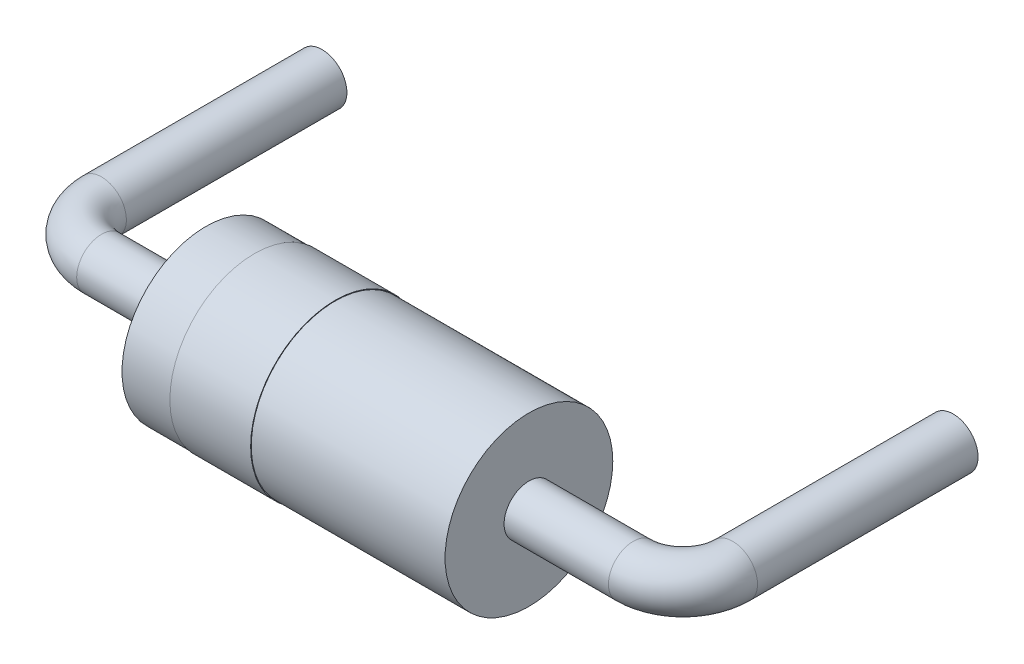
ISO-10303-21;
HEADER;
FILE_DESCRIPTION(('STEP AP214'),'2;1');
FILE_NAME('part.step','',(''),(''),'','','');
FILE_SCHEMA(('AUTOMOTIVE_DESIGN { 1 0 10303 214 1 1 1 1 }'));
ENDSEC;
DATA;
#1=APPLICATION_CONTEXT('core data for automotive mechanical design processes');
#2=APPLICATION_PROTOCOL_DEFINITION('international standard','automotive_design',2000,#1);
#3=PRODUCT_CONTEXT('',#1,'mechanical');
#4=PRODUCT('Part','Part','',(#3));
#5=PRODUCT_RELATED_PRODUCT_CATEGORY('part','',(#4));
#6=PRODUCT_DEFINITION_FORMATION('','',#4);
#7=PRODUCT_DEFINITION_CONTEXT('part definition',#1,'design');
#8=PRODUCT_DEFINITION('design','',#6,#7);
#9=PRODUCT_DEFINITION_SHAPE('','',#8);
#10=(LENGTH_UNIT() NAMED_UNIT(*) SI_UNIT(.MILLI.,.METRE.));
#11=(NAMED_UNIT(*) PLANE_ANGLE_UNIT() SI_UNIT($,.RADIAN.));
#12=(NAMED_UNIT(*) SI_UNIT($,.STERADIAN.) SOLID_ANGLE_UNIT());
#13=UNCERTAINTY_MEASURE_WITH_UNIT(LENGTH_MEASURE(1.E-05),#10,'distance_accuracy_value','');
#14=(GEOMETRIC_REPRESENTATION_CONTEXT(3) GLOBAL_UNCERTAINTY_ASSIGNED_CONTEXT((#13)) GLOBAL_UNIT_ASSIGNED_CONTEXT((#10,
#11,#12)) REPRESENTATION_CONTEXT('',''));
#15=CARTESIAN_POINT('',(0.,0.,0.));
#16=DIRECTION('',(0.,0.,1.));
#17=DIRECTION('',(1.,0.,0.));
#18=AXIS2_PLACEMENT_3D('',#15,#16,#17);
#19=CARTESIAN_POINT('',(0.4,-0.40808,-2.5));
#20=DIRECTION('',(0.,0.,-1.));
#21=DIRECTION('',(-1.,0.,0.));
#22=AXIS2_PLACEMENT_3D('',#19,#20,#21);
#23=PLANE('',#22);
#24=CARTESIAN_POINT('',(2.59205634386972E-13,0.,-2.5));
#25=DIRECTION('',(0.,0.,1.));
#26=DIRECTION('',(1.,0.,0.));
#27=AXIS2_PLACEMENT_3D('',#24,#25,#26);
#28=CIRCLE('',#27,0.400000000000043);
#29=CARTESIAN_POINT('',(0.400000000000302,0.,-2.5));
#30=VERTEX_POINT('',#29);
#31=EDGE_CURVE('E19',#30,#30,#28,.T.);
#32=ORIENTED_EDGE('',*,*,#31,.F.);
#33=EDGE_LOOP('',(#32));
#34=FACE_BOUND('',#33,.T.);
#35=ADVANCED_FACE('F15',(#34),#23,.T.);
#36=CARTESIAN_POINT('',(2.59205634386972E-13,0.,-2.5));
#37=DIRECTION('',(0.,0.,1.));
#38=DIRECTION('',(1.,0.,0.));
#39=AXIS2_PLACEMENT_3D('',#36,#37,#38);
#40=CYLINDRICAL_SURFACE('',#39,0.400000000000043);
#41=CARTESIAN_POINT('',(2.5969352536459E-13,0.,1.05));
#42=DIRECTION('',(0.,0.,1.));
#43=DIRECTION('',(1.,0.,0.));
#44=AXIS2_PLACEMENT_3D('',#41,#42,#43);
#45=CIRCLE('',#44,0.400000000000044);
#46=CARTESIAN_POINT('',(-0.399999999999784,0.,1.05));
#47=VERTEX_POINT('',#46);
#48=EDGE_CURVE('E31',#47,#47,#45,.T.);
#49=ORIENTED_EDGE('',*,*,#48,.F.);
#50=EDGE_LOOP('',(#49));
#51=FACE_BOUND('',#50,.T.);
#52=ORIENTED_EDGE('',*,*,#31,.T.);
#53=EDGE_LOOP('',(#52));
#54=FACE_BOUND('',#53,.T.);
#55=ADVANCED_FACE('F236',(#51,#54),#40,.T.);
#56=CARTESIAN_POINT('',(0.8,0.,1.05));
#57=DIRECTION('',(0.,1.,0.));
#58=DIRECTION('',(0.,0.,1.));
#59=AXIS2_PLACEMENT_3D('',#56,#57,#58);
#60=TOROIDAL_SURFACE('',#59,0.79999999999974,0.400000000000044);
#61=CARTESIAN_POINT('',(0.8,0.,1.84999999999974));
#62=DIRECTION('',(1.,0.,0.));
#63=DIRECTION('',(0.,0.,-1.));
#64=AXIS2_PLACEMENT_3D('',#61,#62,#63);
#65=CIRCLE('',#64,0.400000000000043);
#66=CARTESIAN_POINT('',(0.8,0.,2.24999999999978));
#67=VERTEX_POINT('',#66);
#68=EDGE_CURVE('E54',#67,#67,#65,.T.);
#69=CARTESIAN_POINT('',(0.8,0.,1.05));
#70=DIRECTION('',(0.,1.,0.));
#71=DIRECTION('',(0.,0.,1.));
#72=AXIS2_PLACEMENT_3D('',#69,#70,#71);
#73=CIRCLE('',#72,1.19999999999978);
#74=EDGE_CURVE('',#47,#67,#73,.T.);
#75=ORIENTED_EDGE('',*,*,#48,.T.);
#76=ORIENTED_EDGE('',*,*,#68,.F.);
#77=ORIENTED_EDGE('',*,*,#74,.T.);
#78=ORIENTED_EDGE('',*,*,#74,.F.);
#79=EDGE_LOOP('',(#75,#77,#76,#78));
#80=FACE_BOUND('',#79,.T.);
#81=ADVANCED_FACE('F227',(#80),#60,.T.);
#82=CARTESIAN_POINT('',(0.8,0.,1.84999999999974));
#83=DIRECTION('',(1.,0.,0.));
#84=DIRECTION('',(0.,0.,-1.));
#85=AXIS2_PLACEMENT_3D('',#82,#83,#84);
#86=CYLINDRICAL_SURFACE('',#85,0.400000000000043);
#87=CARTESIAN_POINT('',(2.48,0.,1.84999999999974));
#88=DIRECTION('',(1.,0.,0.));
#89=DIRECTION('',(0.,0.,-1.));
#90=AXIS2_PLACEMENT_3D('',#87,#88,#89);
#91=CIRCLE('',#90,0.400000000000043);
#92=CARTESIAN_POINT('',(2.48,0.,1.4499999999997));
#93=VERTEX_POINT('',#92);
#94=EDGE_CURVE('E52',#93,#93,#91,.F.);
#95=ORIENTED_EDGE('',*,*,#94,.T.);
#96=EDGE_LOOP('',(#95));
#97=FACE_BOUND('',#96,.T.);
#98=ORIENTED_EDGE('',*,*,#68,.T.);
#99=EDGE_LOOP('',(#98));
#100=FACE_BOUND('',#99,.T.);
#101=ADVANCED_FACE('F217',(#97,#100),#86,.T.);
#102=CARTESIAN_POINT('',(9.76,-0.408,-2.5));
#103=DIRECTION('',(0.,0.,1.));
#104=DIRECTION('',(1.,0.,0.));
#105=AXIS2_PLACEMENT_3D('',#102,#103,#104);
#106=PLANE('',#105);
#107=CARTESIAN_POINT('',(10.1599999999997,0.,-2.5));
#108=DIRECTION('',(0.,0.,-1.));
#109=DIRECTION('',(-1.,0.,0.));
#110=AXIS2_PLACEMENT_3D('',#107,#108,#109);
#111=CIRCLE('',#110,0.400000000000043);
#112=CARTESIAN_POINT('',(9.7599999999997,0.,-2.5));
#113=VERTEX_POINT('',#112);
#114=EDGE_CURVE('E50',#113,#113,#111,.F.);
#115=ORIENTED_EDGE('',*,*,#114,.F.);
#116=EDGE_LOOP('',(#115));
#117=FACE_BOUND('',#116,.T.);
#118=ADVANCED_FACE('F90',(#117),#106,.F.);
#119=CARTESIAN_POINT('',(2.48,1.377,0.5));
#120=DIRECTION('',(1.,0.,0.));
#121=DIRECTION('',(0.,0.,1.));
#122=AXIS2_PLACEMENT_3D('',#119,#120,#121);
#123=PLANE('',#122);
#124=ORIENTED_EDGE('',*,*,#94,.F.);
#125=EDGE_LOOP('',(#124));
#126=FACE_BOUND('',#125,.T.);
#127=CARTESIAN_POINT('',(2.48,0.,1.85000000000001));
#128=DIRECTION('',(1.,0.,0.));
#129=DIRECTION('',(0.,0.,-1.));
#130=AXIS2_PLACEMENT_3D('',#127,#128,#129);
#131=CIRCLE('',#130,1.35);
#132=CARTESIAN_POINT('',(2.48,0.,0.500000000000008));
#133=VERTEX_POINT('',#132);
#134=EDGE_CURVE('E47',#133,#133,#131,.T.);
#135=ORIENTED_EDGE('',*,*,#134,.F.);
#136=EDGE_LOOP('',(#135));
#137=FACE_BOUND('',#136,.T.);
#138=ADVANCED_FACE('F80',(#126,#137),#123,.F.);
#139=CARTESIAN_POINT('',(10.1599999999997,0.,1.05));
#140=DIRECTION('',(0.,0.,-1.));
#141=DIRECTION('',(-1.,0.,0.));
#142=AXIS2_PLACEMENT_3D('',#139,#140,#141);
#143=CYLINDRICAL_SURFACE('',#142,0.400000000000043);
#144=ORIENTED_EDGE('',*,*,#114,.T.);
#145=EDGE_LOOP('',(#144));
#146=FACE_BOUND('',#145,.T.);
#147=CARTESIAN_POINT('',(10.1599999999997,0.,1.05));
#148=DIRECTION('',(0.,0.,1.));
#149=DIRECTION('',(1.,0.,0.));
#150=AXIS2_PLACEMENT_3D('',#147,#148,#149);
#151=CIRCLE('',#150,0.400000000000043);
#152=CARTESIAN_POINT('',(10.5599999999998,0.,1.05));
#153=VERTEX_POINT('',#152);
#154=EDGE_CURVE('E46',#153,#153,#151,.T.);
#155=ORIENTED_EDGE('',*,*,#154,.F.);
#156=EDGE_LOOP('',(#155));
#157=FACE_BOUND('',#156,.T.);
#158=ADVANCED_FACE('F77',(#146,#157),#143,.T.);
#159=CARTESIAN_POINT('',(2.48,0.,1.85000000000001));
#160=DIRECTION('',(1.,0.,0.));
#161=DIRECTION('',(0.,0.,-1.));
#162=AXIS2_PLACEMENT_3D('',#159,#160,#161);
#163=CYLINDRICAL_SURFACE('',#162,1.35);
#164=CARTESIAN_POINT('',(3.26,0.,1.85000000000001));
#165=DIRECTION('',(1.,0.,0.));
#166=DIRECTION('',(0.,0.,-1.));
#167=AXIS2_PLACEMENT_3D('',#164,#165,#166);
#168=CIRCLE('',#167,1.35);
#169=CARTESIAN_POINT('',(3.26,0.,0.500000000000008));
#170=VERTEX_POINT('',#169);
#171=EDGE_CURVE('E43',#170,#170,#168,.F.);
#172=ORIENTED_EDGE('',*,*,#171,.T.);
#173=EDGE_LOOP('',(#172));
#174=FACE_BOUND('',#173,.T.);
#175=ORIENTED_EDGE('',*,*,#134,.T.);
#176=EDGE_LOOP('',(#175));
#177=FACE_BOUND('',#176,.T.);
#178=ADVANCED_FACE('F79',(#174,#177),#163,.T.);
#179=CARTESIAN_POINT('',(3.26,1.3872,0.49));
#180=DIRECTION('',(1.,0.,0.));
#181=DIRECTION('',(0.,0.,1.));
#182=AXIS2_PLACEMENT_3D('',#179,#180,#181);
#183=PLANE('',#182);
#184=ORIENTED_EDGE('',*,*,#171,.F.);
#185=EDGE_LOOP('',(#184));
#186=FACE_BOUND('',#185,.T.);
#187=CARTESIAN_POINT('',(3.26,0.,1.85000000000019));
#188=DIRECTION('',(1.,0.,0.));
#189=DIRECTION('',(0.,0.,-1.));
#190=AXIS2_PLACEMENT_3D('',#187,#188,#189);
#191=CIRCLE('',#190,1.36000000000003);
#192=CARTESIAN_POINT('',(3.26,0.,0.490000000000157));
#193=VERTEX_POINT('',#192);
#194=EDGE_CURVE('E40',#193,#193,#191,.T.);
#195=ORIENTED_EDGE('',*,*,#194,.F.);
#196=EDGE_LOOP('',(#195));
#197=FACE_BOUND('',#196,.T.);
#198=ADVANCED_FACE('F73',(#186,#197),#183,.F.);
#199=CARTESIAN_POINT('',(9.36,0.,1.05));
#200=DIRECTION('',(0.,1.,0.));
#201=DIRECTION('',(0.,0.,1.));
#202=AXIS2_PLACEMENT_3D('',#199,#200,#201);
#203=TOROIDAL_SURFACE('',#202,0.79999999999974,0.400000000000044);
#204=CARTESIAN_POINT('',(9.36,0.,1.84999999999974));
#205=DIRECTION('',(-1.,0.,0.));
#206=DIRECTION('',(0.,0.,1.));
#207=AXIS2_PLACEMENT_3D('',#204,#205,#206);
#208=CIRCLE('',#207,0.400000000000043);
#209=CARTESIAN_POINT('',(9.36,0.,2.24999999999978));
#210=VERTEX_POINT('',#209);
#211=EDGE_CURVE('E39',#210,#210,#208,.T.);
#212=CARTESIAN_POINT('',(9.36,0.,1.05));
#213=DIRECTION('',(0.,1.,0.));
#214=DIRECTION('',(0.,0.,1.));
#215=AXIS2_PLACEMENT_3D('',#212,#213,#214);
#216=CIRCLE('',#215,1.19999999999978);
#217=EDGE_CURVE('',#210,#153,#216,.T.);
#218=ORIENTED_EDGE('',*,*,#211,.F.);
#219=ORIENTED_EDGE('',*,*,#154,.T.);
#220=ORIENTED_EDGE('',*,*,#217,.T.);
#221=ORIENTED_EDGE('',*,*,#217,.F.);
#222=EDGE_LOOP('',(#218,#220,#219,#221));
#223=FACE_BOUND('',#222,.T.);
#224=ADVANCED_FACE('F69',(#223),#203,.T.);
#225=CARTESIAN_POINT('',(3.26,0.,1.85000000000019));
#226=DIRECTION('',(1.,0.,0.));
#227=DIRECTION('',(0.,0.,-1.));
#228=AXIS2_PLACEMENT_3D('',#225,#226,#227);
#229=CYLINDRICAL_SURFACE('',#228,1.36000000000003);
#230=ORIENTED_EDGE('',*,*,#194,.T.);
#231=EDGE_LOOP('',(#230));
#232=FACE_BOUND('',#231,.T.);
#233=CARTESIAN_POINT('',(4.56,0.,1.85000000000019));
#234=DIRECTION('',(1.,0.,0.));
#235=DIRECTION('',(0.,0.,-1.));
#236=AXIS2_PLACEMENT_3D('',#233,#234,#235);
#237=CIRCLE('',#236,1.36000000000003);
#238=CARTESIAN_POINT('',(4.56,0.,0.490000000000157));
#239=VERTEX_POINT('',#238);
#240=EDGE_CURVE('E36',#239,#239,#237,.T.);
#241=ORIENTED_EDGE('',*,*,#240,.F.);
#242=EDGE_LOOP('',(#241));
#243=FACE_BOUND('',#242,.T.);
#244=ADVANCED_FACE('F72',(#232,#243),#229,.T.);
#245=CARTESIAN_POINT('',(7.68,0.,1.84999999999974));
#246=DIRECTION('',(1.,0.,0.));
#247=DIRECTION('',(0.,0.,-1.));
#248=AXIS2_PLACEMENT_3D('',#245,#246,#247);
#249=CYLINDRICAL_SURFACE('',#248,0.400000000000043);
#250=CARTESIAN_POINT('',(7.68,0.,1.84999999999974));
#251=DIRECTION('',(1.,0.,0.));
#252=DIRECTION('',(0.,0.,-1.));
#253=AXIS2_PLACEMENT_3D('',#250,#251,#252);
#254=CIRCLE('',#253,0.400000000000043);
#255=CARTESIAN_POINT('',(7.68,0.,1.4499999999997));
#256=VERTEX_POINT('',#255);
#257=EDGE_CURVE('E28',#256,#256,#254,.F.);
#258=ORIENTED_EDGE('',*,*,#257,.F.);
#259=EDGE_LOOP('',(#258));
#260=FACE_BOUND('',#259,.T.);
#261=ORIENTED_EDGE('',*,*,#211,.T.);
#262=EDGE_LOOP('',(#261));
#263=FACE_BOUND('',#262,.T.);
#264=ADVANCED_FACE('F67',(#260,#263),#249,.T.);
#265=CARTESIAN_POINT('',(4.56,1.387472,0.49));
#266=DIRECTION('',(1.,0.,0.));
#267=DIRECTION('',(0.,0.,1.));
#268=AXIS2_PLACEMENT_3D('',#265,#266,#267);
#269=PLANE('',#268);
#270=CARTESIAN_POINT('',(4.56,0.,1.85000000000001));
#271=DIRECTION('',(1.,0.,0.));
#272=DIRECTION('',(0.,0.,-1.));
#273=AXIS2_PLACEMENT_3D('',#270,#271,#272);
#274=CIRCLE('',#273,1.35);
#275=CARTESIAN_POINT('',(4.56,0.,0.500000000000008));
#276=VERTEX_POINT('',#275);
#277=EDGE_CURVE('E23',#276,#276,#274,.T.);
#278=ORIENTED_EDGE('',*,*,#277,.F.);
#279=EDGE_LOOP('',(#278));
#280=FACE_BOUND('',#279,.T.);
#281=ORIENTED_EDGE('',*,*,#240,.T.);
#282=EDGE_LOOP('',(#281));
#283=FACE_BOUND('',#282,.T.);
#284=ADVANCED_FACE('F98',(#280,#283),#269,.T.);
#285=CARTESIAN_POINT('',(7.68,1.37727,0.5));
#286=DIRECTION('',(1.,0.,0.));
#287=DIRECTION('',(0.,0.,1.));
#288=AXIS2_PLACEMENT_3D('',#285,#286,#287);
#289=PLANE('',#288);
#290=ORIENTED_EDGE('',*,*,#257,.T.);
#291=EDGE_LOOP('',(#290));
#292=FACE_BOUND('',#291,.T.);
#293=CARTESIAN_POINT('',(7.68,0.,1.85000000000001));
#294=DIRECTION('',(1.,0.,0.));
#295=DIRECTION('',(0.,0.,-1.));
#296=AXIS2_PLACEMENT_3D('',#293,#294,#295);
#297=CIRCLE('',#296,1.35);
#298=CARTESIAN_POINT('',(7.68,0.,0.500000000000008));
#299=VERTEX_POINT('',#298);
#300=EDGE_CURVE('E10',#299,#299,#297,.F.);
#301=ORIENTED_EDGE('',*,*,#300,.F.);
#302=EDGE_LOOP('',(#301));
#303=FACE_BOUND('',#302,.T.);
#304=ADVANCED_FACE('F94',(#292,#303),#289,.T.);
#305=CARTESIAN_POINT('',(4.56,0.,1.85000000000001));
#306=DIRECTION('',(1.,0.,0.));
#307=DIRECTION('',(0.,0.,-1.));
#308=AXIS2_PLACEMENT_3D('',#305,#306,#307);
#309=CYLINDRICAL_SURFACE('',#308,1.35);
#310=ORIENTED_EDGE('',*,*,#300,.T.);
#311=EDGE_LOOP('',(#310));
#312=FACE_BOUND('',#311,.T.);
#313=ORIENTED_EDGE('',*,*,#277,.T.);
#314=EDGE_LOOP('',(#313));
#315=FACE_BOUND('',#314,.T.);
#316=ADVANCED_FACE('F17',(#312,#315),#309,.T.);
#317=CLOSED_SHELL('',(#35,#55,#81,#101,#118,#138,#158,#178,#198,#224,#244,#264,#284,#304,#316));
#318=MANIFOLD_SOLID_BREP('B1',#317);
#319=ADVANCED_BREP_SHAPE_REPRESENTATION('',(#18,#318),#14);
#320=SHAPE_DEFINITION_REPRESENTATION(#9,#319);
ENDSEC;
END-ISO-10303-21;
